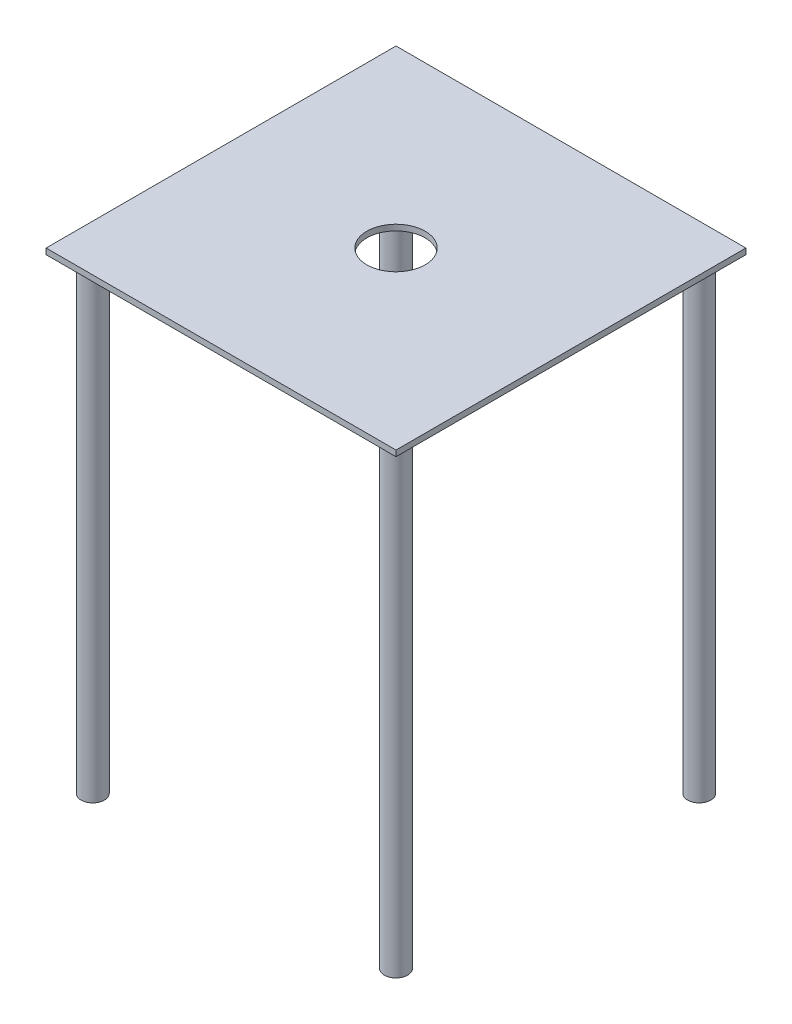
ISO-10303-21;
HEADER;
FILE_DESCRIPTION(('STEP AP214'),'2;1');
FILE_NAME('part.step','',(''),(''),'','','');
FILE_SCHEMA(('AUTOMOTIVE_DESIGN { 1 0 10303 214 1 1 1 1 }'));
ENDSEC;
DATA;
#1=APPLICATION_CONTEXT('core data for automotive mechanical design processes');
#2=APPLICATION_PROTOCOL_DEFINITION('international standard','automotive_design',2000,#1);
#3=PRODUCT_CONTEXT('',#1,'mechanical');
#4=PRODUCT('Part','Part','',(#3));
#5=PRODUCT_RELATED_PRODUCT_CATEGORY('part','',(#4));
#6=PRODUCT_DEFINITION_FORMATION('','',#4);
#7=PRODUCT_DEFINITION_CONTEXT('part definition',#1,'design');
#8=PRODUCT_DEFINITION('design','',#6,#7);
#9=PRODUCT_DEFINITION_SHAPE('','',#8);
#10=(LENGTH_UNIT() NAMED_UNIT(*) SI_UNIT(.MILLI.,.METRE.));
#11=(NAMED_UNIT(*) PLANE_ANGLE_UNIT() SI_UNIT($,.RADIAN.));
#12=(NAMED_UNIT(*) SI_UNIT($,.STERADIAN.) SOLID_ANGLE_UNIT());
#13=UNCERTAINTY_MEASURE_WITH_UNIT(LENGTH_MEASURE(1.E-05),#10,'distance_accuracy_value','');
#14=(GEOMETRIC_REPRESENTATION_CONTEXT(3) GLOBAL_UNCERTAINTY_ASSIGNED_CONTEXT((#13)) GLOBAL_UNIT_ASSIGNED_CONTEXT((#10,
#11,#12)) REPRESENTATION_CONTEXT('',''));
#15=CARTESIAN_POINT('',(0.,0.,0.));
#16=DIRECTION('',(0.,0.,1.));
#17=DIRECTION('',(1.,0.,0.));
#18=AXIS2_PLACEMENT_3D('',#15,#16,#17);
#19=CARTESIAN_POINT('',(-165.1,-508.,165.1));
#20=DIRECTION('',(0.,1.,0.));
#21=DIRECTION('',(0.,0.,1.));
#22=AXIS2_PLACEMENT_3D('',#19,#20,#21);
#23=CYLINDRICAL_SURFACE('',#22,12.7);
#24=CARTESIAN_POINT('',(-165.1,-508.,165.1));
#25=DIRECTION('',(0.,1.,0.));
#26=DIRECTION('',(0.,0.,1.));
#27=AXIS2_PLACEMENT_3D('',#24,#25,#26);
#28=CIRCLE('',#27,12.7);
#29=CARTESIAN_POINT('',(-165.1,-508.,177.8));
#30=VERTEX_POINT('',#29);
#31=EDGE_CURVE('E11',#30,#30,#28,.T.);
#32=ORIENTED_EDGE('',*,*,#31,.T.);
#33=EDGE_LOOP('',(#32));
#34=FACE_BOUND('',#33,.T.);
#35=CARTESIAN_POINT('',(-165.1,0.,165.1));
#36=DIRECTION('',(0.,1.,0.));
#37=DIRECTION('',(0.,0.,1.));
#38=AXIS2_PLACEMENT_3D('',#35,#36,#37);
#39=CIRCLE('',#38,12.7);
#40=CARTESIAN_POINT('',(-165.1,0.,177.8));
#41=VERTEX_POINT('',#40);
#42=EDGE_CURVE('E46',#41,#41,#39,.T.);
#43=ORIENTED_EDGE('',*,*,#42,.F.);
#44=EDGE_LOOP('',(#43));
#45=FACE_BOUND('',#44,.T.);
#46=ADVANCED_FACE('F43',(#34,#45),#23,.T.);
#47=CARTESIAN_POINT('',(-165.1,-508.,165.1));
#48=DIRECTION('',(0.,1.,0.));
#49=DIRECTION('',(0.,0.,1.));
#50=AXIS2_PLACEMENT_3D('',#47,#48,#49);
#51=PLANE('',#50);
#52=ORIENTED_EDGE('',*,*,#31,.F.);
#53=EDGE_LOOP('',(#52));
#54=FACE_BOUND('',#53,.T.);
#55=ADVANCED_FACE('F58',(#54),#51,.F.);
#56=CARTESIAN_POINT('',(-165.1,0.,165.1));
#57=DIRECTION('',(0.,1.,0.));
#58=DIRECTION('',(0.,0.,1.));
#59=AXIS2_PLACEMENT_3D('',#56,#57,#58);
#60=PLANE('',#59);
#61=ORIENTED_EDGE('',*,*,#42,.T.);
#62=EDGE_LOOP('',(#61));
#63=FACE_BOUND('',#62,.T.);
#64=ADVANCED_FACE('F55',(#63),#60,.T.);
#65=CLOSED_SHELL('',(#46,#55,#64));
#66=MANIFOLD_SOLID_BREP('B2',#65);
#67=CARTESIAN_POINT('',(165.1,-508.,165.1));
#68=DIRECTION('',(0.,1.,0.));
#69=DIRECTION('',(0.,0.,1.));
#70=AXIS2_PLACEMENT_3D('',#67,#68,#69);
#71=CYLINDRICAL_SURFACE('',#70,12.7);
#72=CARTESIAN_POINT('',(165.1,-508.,165.1));
#73=DIRECTION('',(0.,1.,0.));
#74=DIRECTION('',(0.,0.,-1.));
#75=AXIS2_PLACEMENT_3D('',#72,#73,#74);
#76=CIRCLE('',#75,12.7);
#77=CARTESIAN_POINT('',(165.1,-508.,152.4));
#78=VERTEX_POINT('',#77);
#79=EDGE_CURVE('E42',#78,#78,#76,.T.);
#80=ORIENTED_EDGE('',*,*,#79,.T.);
#81=EDGE_LOOP('',(#80));
#82=FACE_BOUND('',#81,.T.);
#83=CARTESIAN_POINT('',(165.1,0.,165.1));
#84=DIRECTION('',(0.,1.,0.));
#85=DIRECTION('',(0.,0.,-1.));
#86=AXIS2_PLACEMENT_3D('',#83,#84,#85);
#87=CIRCLE('',#86,12.7);
#88=CARTESIAN_POINT('',(165.1,0.,152.4));
#89=VERTEX_POINT('',#88);
#90=EDGE_CURVE('E94',#89,#89,#87,.T.);
#91=ORIENTED_EDGE('',*,*,#90,.F.);
#92=EDGE_LOOP('',(#91));
#93=FACE_BOUND('',#92,.T.);
#94=ADVANCED_FACE('F91',(#82,#93),#71,.T.);
#95=CARTESIAN_POINT('',(165.1,-508.,165.1));
#96=DIRECTION('',(0.,-1.,0.));
#97=DIRECTION('',(0.,0.,-1.));
#98=AXIS2_PLACEMENT_3D('',#95,#96,#97);
#99=PLANE('',#98);
#100=ORIENTED_EDGE('',*,*,#79,.F.);
#101=EDGE_LOOP('',(#100));
#102=FACE_BOUND('',#101,.T.);
#103=ADVANCED_FACE('F106',(#102),#99,.T.);
#104=CARTESIAN_POINT('',(165.1,0.,165.1));
#105=DIRECTION('',(0.,-1.,0.));
#106=DIRECTION('',(0.,0.,-1.));
#107=AXIS2_PLACEMENT_3D('',#104,#105,#106);
#108=PLANE('',#107);
#109=ORIENTED_EDGE('',*,*,#90,.T.);
#110=EDGE_LOOP('',(#109));
#111=FACE_BOUND('',#110,.T.);
#112=ADVANCED_FACE('F103',(#111),#108,.F.);
#113=CLOSED_SHELL('',(#94,#103,#112));
#114=MANIFOLD_SOLID_BREP('B6',#113);
#115=CARTESIAN_POINT('',(-165.1,-508.,-165.1));
#116=DIRECTION('',(0.,1.,0.));
#117=DIRECTION('',(0.,0.,1.));
#118=AXIS2_PLACEMENT_3D('',#115,#116,#117);
#119=CYLINDRICAL_SURFACE('',#118,12.7);
#120=CARTESIAN_POINT('',(-165.1,-508.,-165.1));
#121=DIRECTION('',(0.,1.,0.));
#122=DIRECTION('',(0.,0.,-1.));
#123=AXIS2_PLACEMENT_3D('',#120,#121,#122);
#124=CIRCLE('',#123,12.7);
#125=CARTESIAN_POINT('',(-165.1,-508.,-177.8));
#126=VERTEX_POINT('',#125);
#127=EDGE_CURVE('E90',#126,#126,#124,.T.);
#128=ORIENTED_EDGE('',*,*,#127,.T.);
#129=EDGE_LOOP('',(#128));
#130=FACE_BOUND('',#129,.T.);
#131=CARTESIAN_POINT('',(-165.1,0.,-165.1));
#132=DIRECTION('',(0.,1.,0.));
#133=DIRECTION('',(0.,0.,-1.));
#134=AXIS2_PLACEMENT_3D('',#131,#132,#133);
#135=CIRCLE('',#134,12.7);
#136=CARTESIAN_POINT('',(-165.1,0.,-177.8));
#137=VERTEX_POINT('',#136);
#138=EDGE_CURVE('E142',#137,#137,#135,.T.);
#139=ORIENTED_EDGE('',*,*,#138,.F.);
#140=EDGE_LOOP('',(#139));
#141=FACE_BOUND('',#140,.T.);
#142=ADVANCED_FACE('F139',(#130,#141),#119,.T.);
#143=CARTESIAN_POINT('',(-165.1,-508.,-165.1));
#144=DIRECTION('',(0.,-1.,0.));
#145=DIRECTION('',(0.,0.,-1.));
#146=AXIS2_PLACEMENT_3D('',#143,#144,#145);
#147=PLANE('',#146);
#148=ORIENTED_EDGE('',*,*,#127,.F.);
#149=EDGE_LOOP('',(#148));
#150=FACE_BOUND('',#149,.T.);
#151=ADVANCED_FACE('F154',(#150),#147,.T.);
#152=CARTESIAN_POINT('',(-165.1,0.,-165.1));
#153=DIRECTION('',(0.,-1.,0.));
#154=DIRECTION('',(0.,0.,-1.));
#155=AXIS2_PLACEMENT_3D('',#152,#153,#154);
#156=PLANE('',#155);
#157=ORIENTED_EDGE('',*,*,#138,.T.);
#158=EDGE_LOOP('',(#157));
#159=FACE_BOUND('',#158,.T.);
#160=ADVANCED_FACE('F151',(#159),#156,.F.);
#161=CLOSED_SHELL('',(#142,#151,#160));
#162=MANIFOLD_SOLID_BREP('B37',#161);
#163=CARTESIAN_POINT('',(165.1,-508.,-165.1));
#164=DIRECTION('',(0.,1.,0.));
#165=DIRECTION('',(0.,0.,1.));
#166=AXIS2_PLACEMENT_3D('',#163,#164,#165);
#167=CYLINDRICAL_SURFACE('',#166,12.7);
#168=CARTESIAN_POINT('',(165.1,-508.,-165.1));
#169=DIRECTION('',(0.,1.,0.));
#170=DIRECTION('',(0.,0.,1.));
#171=AXIS2_PLACEMENT_3D('',#168,#169,#170);
#172=CIRCLE('',#171,12.7);
#173=CARTESIAN_POINT('',(165.1,-508.,-152.4));
#174=VERTEX_POINT('',#173);
#175=EDGE_CURVE('E138',#174,#174,#172,.T.);
#176=ORIENTED_EDGE('',*,*,#175,.T.);
#177=EDGE_LOOP('',(#176));
#178=FACE_BOUND('',#177,.T.);
#179=CARTESIAN_POINT('',(165.1,0.,-165.1));
#180=DIRECTION('',(0.,1.,0.));
#181=DIRECTION('',(0.,0.,1.));
#182=AXIS2_PLACEMENT_3D('',#179,#180,#181);
#183=CIRCLE('',#182,12.7);
#184=CARTESIAN_POINT('',(165.1,0.,-152.4));
#185=VERTEX_POINT('',#184);
#186=EDGE_CURVE('E191',#185,#185,#183,.T.);
#187=ORIENTED_EDGE('',*,*,#186,.F.);
#188=EDGE_LOOP('',(#187));
#189=FACE_BOUND('',#188,.T.);
#190=ADVANCED_FACE('F188',(#178,#189),#167,.T.);
#191=CARTESIAN_POINT('',(165.1,-508.,-165.1));
#192=DIRECTION('',(0.,1.,0.));
#193=DIRECTION('',(0.,0.,1.));
#194=AXIS2_PLACEMENT_3D('',#191,#192,#193);
#195=PLANE('',#194);
#196=ORIENTED_EDGE('',*,*,#175,.F.);
#197=EDGE_LOOP('',(#196));
#198=FACE_BOUND('',#197,.T.);
#199=ADVANCED_FACE('F203',(#198),#195,.F.);
#200=CARTESIAN_POINT('',(165.1,0.,-165.1));
#201=DIRECTION('',(0.,1.,0.));
#202=DIRECTION('',(0.,0.,1.));
#203=AXIS2_PLACEMENT_3D('',#200,#201,#202);
#204=PLANE('',#203);
#205=ORIENTED_EDGE('',*,*,#186,.T.);
#206=EDGE_LOOP('',(#205));
#207=FACE_BOUND('',#206,.T.);
#208=ADVANCED_FACE('F200',(#207),#204,.T.);
#209=CLOSED_SHELL('',(#190,#199,#208));
#210=MANIFOLD_SOLID_BREP('B85',#209);
#211=CARTESIAN_POINT('',(-190.5,6.35,-190.5));
#212=DIRECTION('',(1.,0.,0.));
#213=DIRECTION('',(0.,0.,-1.));
#214=AXIS2_PLACEMENT_3D('',#211,#212,#213);
#215=PLANE('',#214);
#216=DIRECTION('',(0.,0.,1.));
#217=VECTOR('',#216,1.);
#218=CARTESIAN_POINT('',(-190.5,0.,-190.5));
#219=LINE('',#218,#217);
#220=CARTESIAN_POINT('',(-190.5,0.,-190.5));
#221=VERTEX_POINT('',#220);
#222=CARTESIAN_POINT('',(-190.5,0.,190.5));
#223=VERTEX_POINT('',#222);
#224=EDGE_CURVE('E291',#221,#223,#219,.T.);
#225=ORIENTED_EDGE('',*,*,#224,.T.);
#226=DIRECTION('',(0.,-1.,0.));
#227=VECTOR('',#226,1.);
#228=CARTESIAN_POINT('',(-190.5,6.35,190.5));
#229=LINE('',#228,#227);
#230=CARTESIAN_POINT('',(-190.5,6.35,190.5));
#231=VERTEX_POINT('',#230);
#232=EDGE_CURVE('E186',#231,#223,#229,.T.);
#233=ORIENTED_EDGE('',*,*,#232,.F.);
#234=DIRECTION('',(0.,0.,1.));
#235=VECTOR('',#234,1.);
#236=CARTESIAN_POINT('',(-190.5,6.35,-190.5));
#237=LINE('',#236,#235);
#238=CARTESIAN_POINT('',(-190.5,6.35,-190.5));
#239=VERTEX_POINT('',#238);
#240=EDGE_CURVE('E279',#239,#231,#237,.T.);
#241=ORIENTED_EDGE('',*,*,#240,.F.);
#242=DIRECTION('',(0.,-1.,0.));
#243=VECTOR('',#242,1.);
#244=CARTESIAN_POINT('',(-190.5,6.35,-190.5));
#245=LINE('',#244,#243);
#246=EDGE_CURVE('E287',#239,#221,#245,.T.);
#247=ORIENTED_EDGE('',*,*,#246,.T.);
#248=EDGE_LOOP('',(#225,#233,#241,#247));
#249=FACE_BOUND('',#248,.T.);
#250=ADVANCED_FACE('F228',(#249),#215,.F.);
#251=CARTESIAN_POINT('',(-190.5,6.35,190.5));
#252=DIRECTION('',(0.,0.,-1.));
#253=DIRECTION('',(-1.,0.,0.));
#254=AXIS2_PLACEMENT_3D('',#251,#252,#253);
#255=PLANE('',#254);
#256=DIRECTION('',(1.,0.,0.));
#257=VECTOR('',#256,1.);
#258=CARTESIAN_POINT('',(-190.5,0.,190.5));
#259=LINE('',#258,#257);
#260=CARTESIAN_POINT('',(190.5,0.,190.5));
#261=VERTEX_POINT('',#260);
#262=EDGE_CURVE('E283',#223,#261,#259,.T.);
#263=ORIENTED_EDGE('',*,*,#262,.T.);
#264=DIRECTION('',(0.,-1.,0.));
#265=VECTOR('',#264,1.);
#266=CARTESIAN_POINT('',(190.5,6.35,190.5));
#267=LINE('',#266,#265);
#268=CARTESIAN_POINT('',(190.5,6.35,190.5));
#269=VERTEX_POINT('',#268);
#270=EDGE_CURVE('E236',#269,#261,#267,.T.);
#271=ORIENTED_EDGE('',*,*,#270,.F.);
#272=DIRECTION('',(1.,0.,0.));
#273=VECTOR('',#272,1.);
#274=CARTESIAN_POINT('',(-190.5,6.35,190.5));
#275=LINE('',#274,#273);
#276=EDGE_CURVE('E274',#231,#269,#275,.T.);
#277=ORIENTED_EDGE('',*,*,#276,.F.);
#278=ORIENTED_EDGE('',*,*,#232,.T.);
#279=EDGE_LOOP('',(#263,#271,#277,#278));
#280=FACE_BOUND('',#279,.T.);
#281=ADVANCED_FACE('F282',(#280),#255,.F.);
#282=CARTESIAN_POINT('',(190.5,6.35,-190.5));
#283=DIRECTION('',(-1.,0.,0.));
#284=DIRECTION('',(0.,0.,1.));
#285=AXIS2_PLACEMENT_3D('',#282,#283,#284);
#286=PLANE('',#285);
#287=DIRECTION('',(0.,0.,-1.));
#288=VECTOR('',#287,1.);
#289=CARTESIAN_POINT('',(190.5,0.,-190.5));
#290=LINE('',#289,#288);
#291=CARTESIAN_POINT('',(190.5,0.,-190.5));
#292=VERTEX_POINT('',#291);
#293=EDGE_CURVE('E261',#261,#292,#290,.T.);
#294=ORIENTED_EDGE('',*,*,#293,.T.);
#295=DIRECTION('',(0.,-1.,0.));
#296=VECTOR('',#295,1.);
#297=CARTESIAN_POINT('',(190.5,6.35,-190.5));
#298=LINE('',#297,#296);
#299=CARTESIAN_POINT('',(190.5,6.35,-190.5));
#300=VERTEX_POINT('',#299);
#301=EDGE_CURVE('E284',#300,#292,#298,.T.);
#302=ORIENTED_EDGE('',*,*,#301,.F.);
#303=DIRECTION('',(0.,0.,-1.));
#304=VECTOR('',#303,1.);
#305=CARTESIAN_POINT('',(190.5,6.35,-190.5));
#306=LINE('',#305,#304);
#307=EDGE_CURVE('E277',#269,#300,#306,.T.);
#308=ORIENTED_EDGE('',*,*,#307,.F.);
#309=ORIENTED_EDGE('',*,*,#270,.T.);
#310=EDGE_LOOP('',(#294,#302,#308,#309));
#311=FACE_BOUND('',#310,.T.);
#312=ADVANCED_FACE('F285',(#311),#286,.F.);
#313=CARTESIAN_POINT('',(-190.5,6.35,-190.5));
#314=DIRECTION('',(0.,0.,1.));
#315=DIRECTION('',(1.,0.,0.));
#316=AXIS2_PLACEMENT_3D('',#313,#314,#315);
#317=PLANE('',#316);
#318=DIRECTION('',(-1.,0.,0.));
#319=VECTOR('',#318,1.);
#320=CARTESIAN_POINT('',(-190.5,0.,-190.5));
#321=LINE('',#320,#319);
#322=EDGE_CURVE('E267',#292,#221,#321,.T.);
#323=ORIENTED_EDGE('',*,*,#322,.T.);
#324=ORIENTED_EDGE('',*,*,#246,.F.);
#325=DIRECTION('',(-1.,0.,0.));
#326=VECTOR('',#325,1.);
#327=CARTESIAN_POINT('',(-190.5,6.35,-190.5));
#328=LINE('',#327,#326);
#329=EDGE_CURVE('E244',#300,#239,#328,.T.);
#330=ORIENTED_EDGE('',*,*,#329,.F.);
#331=ORIENTED_EDGE('',*,*,#301,.T.);
#332=EDGE_LOOP('',(#323,#324,#330,#331));
#333=FACE_BOUND('',#332,.T.);
#334=ADVANCED_FACE('F299',(#333),#317,.F.);
#335=CARTESIAN_POINT('',(-190.5,6.35,190.5));
#336=DIRECTION('',(0.,1.,0.));
#337=DIRECTION('',(0.,0.,1.));
#338=AXIS2_PLACEMENT_3D('',#335,#336,#337);
#339=PLANE('',#338);
#340=CARTESIAN_POINT('',(0.,6.35,0.));
#341=DIRECTION('',(0.,1.,0.));
#342=DIRECTION('',(0.,0.,1.));
#343=AXIS2_PLACEMENT_3D('',#340,#341,#342);
#344=CIRCLE('',#343,31.75);
#345=CARTESIAN_POINT('',(0.,6.35,31.75));
#346=VERTEX_POINT('',#345);
#347=EDGE_CURVE('E305',#346,#346,#344,.T.);
#348=ORIENTED_EDGE('',*,*,#347,.F.);
#349=EDGE_LOOP('',(#348));
#350=FACE_BOUND('',#349,.T.);
#351=ORIENTED_EDGE('',*,*,#240,.T.);
#352=ORIENTED_EDGE('',*,*,#276,.T.);
#353=ORIENTED_EDGE('',*,*,#307,.T.);
#354=ORIENTED_EDGE('',*,*,#329,.T.);
#355=EDGE_LOOP('',(#351,#352,#353,#354));
#356=FACE_BOUND('',#355,.T.);
#357=ADVANCED_FACE('F275',(#350,#356),#339,.T.);
#358=CARTESIAN_POINT('',(-190.5,0.,190.5));
#359=DIRECTION('',(0.,1.,0.));
#360=DIRECTION('',(0.,0.,1.));
#361=AXIS2_PLACEMENT_3D('',#358,#359,#360);
#362=PLANE('',#361);
#363=CARTESIAN_POINT('',(0.,0.,0.));
#364=DIRECTION('',(0.,1.,0.));
#365=DIRECTION('',(0.,0.,1.));
#366=AXIS2_PLACEMENT_3D('',#363,#364,#365);
#367=CIRCLE('',#366,31.75);
#368=CARTESIAN_POINT('',(0.,0.,31.75));
#369=VERTEX_POINT('',#368);
#370=EDGE_CURVE('E294',#369,#369,#367,.T.);
#371=ORIENTED_EDGE('',*,*,#370,.T.);
#372=EDGE_LOOP('',(#371));
#373=FACE_BOUND('',#372,.T.);
#374=ORIENTED_EDGE('',*,*,#224,.F.);
#375=ORIENTED_EDGE('',*,*,#322,.F.);
#376=ORIENTED_EDGE('',*,*,#293,.F.);
#377=ORIENTED_EDGE('',*,*,#262,.F.);
#378=EDGE_LOOP('',(#374,#375,#376,#377));
#379=FACE_BOUND('',#378,.T.);
#380=ADVANCED_FACE('F302',(#373,#379),#362,.F.);
#381=CARTESIAN_POINT('',(0.,0.,0.));
#382=DIRECTION('',(0.,1.,0.));
#383=DIRECTION('',(0.,0.,1.));
#384=AXIS2_PLACEMENT_3D('',#381,#382,#383);
#385=CYLINDRICAL_SURFACE('',#384,31.75);
#386=ORIENTED_EDGE('',*,*,#370,.F.);
#387=EDGE_LOOP('',(#386));
#388=FACE_BOUND('',#387,.T.);
#389=ORIENTED_EDGE('',*,*,#347,.T.);
#390=EDGE_LOOP('',(#389));
#391=FACE_BOUND('',#390,.T.);
#392=ADVANCED_FACE('F312',(#388,#391),#385,.F.);
#393=CLOSED_SHELL('',(#250,#281,#312,#334,#357,#380,#392));
#394=MANIFOLD_SOLID_BREP('B133',#393);
#395=ADVANCED_BREP_SHAPE_REPRESENTATION('',(#18,#66,#114,#162,#210,#394),#14);
#396=SHAPE_DEFINITION_REPRESENTATION(#9,#395);
ENDSEC;
END-ISO-10303-21;
